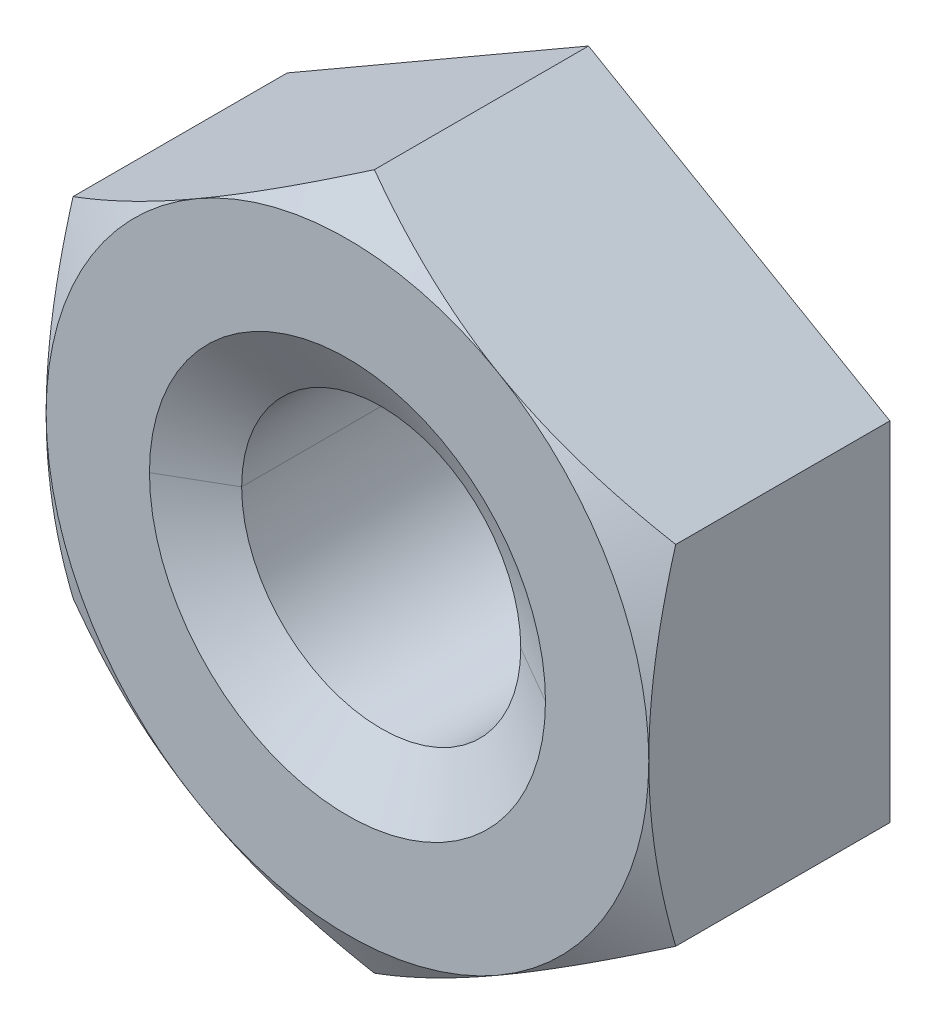
ISO-10303-21;
HEADER;
FILE_DESCRIPTION(('STEP AP214'),'2;1');
FILE_NAME('part.step','',(''),(''),'','','');
FILE_SCHEMA(('AUTOMOTIVE_DESIGN { 1 0 10303 214 1 1 1 1 }'));
ENDSEC;
DATA;
#1=APPLICATION_CONTEXT('core data for automotive mechanical design processes');
#2=APPLICATION_PROTOCOL_DEFINITION('international standard','automotive_design',2000,#1);
#3=PRODUCT_CONTEXT('',#1,'mechanical');
#4=PRODUCT('Part','Part','',(#3));
#5=PRODUCT_RELATED_PRODUCT_CATEGORY('part','',(#4));
#6=PRODUCT_DEFINITION_FORMATION('','',#4);
#7=PRODUCT_DEFINITION_CONTEXT('part definition',#1,'design');
#8=PRODUCT_DEFINITION('design','',#6,#7);
#9=PRODUCT_DEFINITION_SHAPE('','',#8);
#10=(LENGTH_UNIT() NAMED_UNIT(*) SI_UNIT(.MILLI.,.METRE.));
#11=(NAMED_UNIT(*) PLANE_ANGLE_UNIT() SI_UNIT($,.RADIAN.));
#12=(NAMED_UNIT(*) SI_UNIT($,.STERADIAN.) SOLID_ANGLE_UNIT());
#13=UNCERTAINTY_MEASURE_WITH_UNIT(LENGTH_MEASURE(1.E-05),#10,'distance_accuracy_value','');
#14=(GEOMETRIC_REPRESENTATION_CONTEXT(3) GLOBAL_UNCERTAINTY_ASSIGNED_CONTEXT((#13)) GLOBAL_UNIT_ASSIGNED_CONTEXT((#10,
#11,#12)) REPRESENTATION_CONTEXT('',''));
#15=CARTESIAN_POINT('',(0.,0.,0.));
#16=DIRECTION('',(0.,0.,1.));
#17=DIRECTION('',(1.,0.,0.));
#18=AXIS2_PLACEMENT_3D('',#15,#16,#17);
#19=CARTESIAN_POINT('',(0.,-2.95,-2.8));
#20=DIRECTION('',(0.,0.,-1.));
#21=DIRECTION('',(0.,-1.,0.));
#22=AXIS2_PLACEMENT_3D('',#19,#20,#21);
#23=PLANE('',#22);
#24=CARTESIAN_POINT('',(0.,0.,-2.8));
#25=DIRECTION('',(0.,0.,1.));
#26=DIRECTION('',(1.,0.,0.));
#27=AXIS2_PLACEMENT_3D('',#24,#25,#26);
#28=CIRCLE('',#27,2.95);
#29=CARTESIAN_POINT('',(2.95,0.,-2.8));
#30=VERTEX_POINT('',#29);
#31=CARTESIAN_POINT('',(-2.95,0.,-2.8));
#32=VERTEX_POINT('',#31);
#33=EDGE_CURVE('E484',#30,#32,#28,.T.);
#34=ORIENTED_EDGE('',*,*,#33,.T.);
#35=CARTESIAN_POINT('',(0.,0.,-2.8));
#36=DIRECTION('',(0.,0.,1.));
#37=DIRECTION('',(1.,0.,0.));
#38=AXIS2_PLACEMENT_3D('',#35,#36,#37);
#39=CIRCLE('',#38,2.95);
#40=EDGE_CURVE('E11',#32,#30,#39,.T.);
#41=ORIENTED_EDGE('',*,*,#40,.T.);
#42=EDGE_LOOP('',(#34,#41));
#43=FACE_BOUND('',#42,.T.);
#44=DIRECTION('',(0.,1.,0.));
#45=VECTOR('',#44,1.);
#46=CARTESIAN_POINT('',(3.5,-2.02072594216369,-2.8));
#47=LINE('',#46,#45);
#48=CARTESIAN_POINT('',(3.5,-2.02072594216369,-2.8));
#49=VERTEX_POINT('',#48);
#50=CARTESIAN_POINT('',(3.5,2.02072594216366,-2.8));
#51=VERTEX_POINT('',#50);
#52=EDGE_CURVE('E169',#49,#51,#47,.T.);
#53=ORIENTED_EDGE('',*,*,#52,.F.);
#54=DIRECTION('',(0.866025403784441,0.5,0.));
#55=VECTOR('',#54,1.);
#56=CARTESIAN_POINT('',(0.,-4.04145188432737,-2.8));
#57=LINE('',#56,#55);
#58=CARTESIAN_POINT('',(0.,-4.04145188432738,-2.8));
#59=VERTEX_POINT('',#58);
#60=EDGE_CURVE('E402',#59,#49,#57,.T.);
#61=ORIENTED_EDGE('',*,*,#60,.F.);
#62=DIRECTION('',(0.866025403784438,-0.5,0.));
#63=VECTOR('',#62,1.);
#64=CARTESIAN_POINT('',(-3.5,-2.02072594216367,-2.8));
#65=LINE('',#64,#63);
#66=CARTESIAN_POINT('',(-3.5,-2.02072594216368,-2.8));
#67=VERTEX_POINT('',#66);
#68=EDGE_CURVE('E550',#67,#59,#65,.T.);
#69=ORIENTED_EDGE('',*,*,#68,.F.);
#70=DIRECTION('',(0.,-1.,0.));
#71=VECTOR('',#70,1.);
#72=CARTESIAN_POINT('',(-3.5,2.0207259421637,-2.8));
#73=LINE('',#72,#71);
#74=CARTESIAN_POINT('',(-3.5,2.0207259421637,-2.8));
#75=VERTEX_POINT('',#74);
#76=EDGE_CURVE('E507',#75,#67,#73,.T.);
#77=ORIENTED_EDGE('',*,*,#76,.F.);
#78=DIRECTION('',(-0.866025403784439,-0.5,0.));
#79=VECTOR('',#78,1.);
#80=CARTESIAN_POINT('',(0.,4.04145188432738,-2.8));
#81=LINE('',#80,#79);
#82=CARTESIAN_POINT('',(0.,4.04145188432738,-2.8));
#83=VERTEX_POINT('',#82);
#84=EDGE_CURVE('E186',#83,#75,#81,.T.);
#85=ORIENTED_EDGE('',*,*,#84,.F.);
#86=DIRECTION('',(-0.866025403784437,0.5,0.));
#87=VECTOR('',#86,1.);
#88=CARTESIAN_POINT('',(3.5,2.02072594216367,-2.8));
#89=LINE('',#88,#87);
#90=EDGE_CURVE('E184',#51,#83,#89,.T.);
#91=ORIENTED_EDGE('',*,*,#90,.F.);
#92=EDGE_LOOP('',(#53,#61,#69,#77,#85,#91));
#93=FACE_BOUND('',#92,.T.);
#94=ADVANCED_FACE('F17',(#43,#93),#23,.T.);
#95=CARTESIAN_POINT('',(0.,0.,0.));
#96=DIRECTION('',(0.,0.,1.));
#97=DIRECTION('',(1.,0.,0.));
#98=AXIS2_PLACEMENT_3D('',#95,#96,#97);
#99=CYLINDRICAL_SURFACE('',#98,2.95);
#100=DIRECTION('',(0.,0.,1.));
#101=VECTOR('',#100,1.);
#102=CARTESIAN_POINT('',(-2.95,0.,0.));
#103=LINE('',#102,#101);
#104=CARTESIAN_POINT('',(-2.95,0.,-3.2));
#105=VERTEX_POINT('',#104);
#106=EDGE_CURVE('E488',#105,#32,#103,.T.);
#107=ORIENTED_EDGE('',*,*,#106,.F.);
#108=CARTESIAN_POINT('',(0.,0.,-3.2));
#109=DIRECTION('',(0.,0.,1.));
#110=DIRECTION('',(1.,0.,0.));
#111=AXIS2_PLACEMENT_3D('',#108,#109,#110);
#112=CIRCLE('',#111,2.95);
#113=CARTESIAN_POINT('',(2.95,0.,-3.2));
#114=VERTEX_POINT('',#113);
#115=EDGE_CURVE('E565',#105,#114,#112,.T.);
#116=ORIENTED_EDGE('',*,*,#115,.T.);
#117=DIRECTION('',(0.,0.,1.));
#118=VECTOR('',#117,1.);
#119=CARTESIAN_POINT('',(2.95,0.,0.));
#120=LINE('',#119,#118);
#121=EDGE_CURVE('E487',#114,#30,#120,.T.);
#122=ORIENTED_EDGE('',*,*,#121,.T.);
#123=ORIENTED_EDGE('',*,*,#40,.F.);
#124=EDGE_LOOP('',(#107,#116,#122,#123));
#125=FACE_BOUND('',#124,.T.);
#126=ADVANCED_FACE('F727',(#125),#99,.T.);
#127=CARTESIAN_POINT('',(0.,0.,0.));
#128=DIRECTION('',(0.,0.,-1.));
#129=DIRECTION('',(1.,0.,0.));
#130=AXIS2_PLACEMENT_3D('',#127,#128,#129);
#131=CONICAL_SURFACE('',#130,3.5,1.0471975511966);
#132=CARTESIAN_POINT('',(0.,0.,0.));
#133=DIRECTION('',(0.,0.,1.));
#134=DIRECTION('',(1.,0.,0.));
#135=AXIS2_PLACEMENT_3D('',#132,#133,#134);
#136=CIRCLE('',#135,3.5);
#137=CARTESIAN_POINT('',(3.5,0.,0.));
#138=VERTEX_POINT('',#137);
#139=CARTESIAN_POINT('',(1.75,3.03108891324553,0.));
#140=VERTEX_POINT('',#139);
#141=EDGE_CURVE('E359',#138,#140,#136,.T.);
#142=ORIENTED_EDGE('',*,*,#141,.F.);
#143=CARTESIAN_POINT('',(3.50000000000001,2.02072594216367,-0.31260739116964));
#144=CARTESIAN_POINT('',(3.50000000000001,1.49793539188129,-0.161690758701981));
#145=CARTESIAN_POINT('',(3.50000000000001,1.0255966782608,-0.084968602514275));
#146=CARTESIAN_POINT('',(3.50000000000001,0.502488851213621,0.));
#147=CARTESIAN_POINT('',(3.50000000000001,0.,0.));
#148=B_SPLINE_CURVE_WITH_KNOTS('',2,(#143,#144,#145,#146,#147),.UNSPECIFIED.,.F.,.F.,(3,2,3),
(0.,0.5,1.),.UNSPECIFIED.);
#149=CARTESIAN_POINT('',(3.5,2.02072594216367,-0.312607391169643));
#150=VERTEX_POINT('',#149);
#151=EDGE_CURVE('E181',#150,#138,#148,.T.);
#152=ORIENTED_EDGE('',*,*,#151,.F.);
#153=CARTESIAN_POINT('',(1.74999999999999,3.03108891324552,0.));
#154=CARTESIAN_POINT('',(2.1832669510642,2.78094212241763,0.));
#155=CARTESIAN_POINT('',(2.63508824335189,2.52008297768973,-0.0843875357508699));
#156=CARTESIAN_POINT('',(3.04504654740125,2.28339344049031,-0.160956240302545));
#157=CARTESIAN_POINT('',(3.5,2.02072594216367,-0.31260739116964));
#158=B_SPLINE_CURVE_WITH_KNOTS('',2,(#153,#154,#155,#156,#157),.UNSPECIFIED.,.F.,.F.,(3,2,3),
(0.,0.5,1.),.UNSPECIFIED.);
#159=EDGE_CURVE('E197',#140,#150,#158,.T.);
#160=ORIENTED_EDGE('',*,*,#159,.F.);
#161=EDGE_LOOP('',(#142,#152,#160));
#162=FACE_BOUND('',#161,.T.);
#163=ADVANCED_FACE('F723',(#162),#131,.T.);
#164=CARTESIAN_POINT('',(0.,0.,0.));
#165=DIRECTION('',(0.,0.,-1.));
#166=DIRECTION('',(1.,0.,0.));
#167=AXIS2_PLACEMENT_3D('',#164,#165,#166);
#168=CONICAL_SURFACE('',#167,3.5,1.0471975511966);
#169=CARTESIAN_POINT('',(0.,0.,0.));
#170=DIRECTION('',(0.,0.,1.));
#171=DIRECTION('',(1.,0.,0.));
#172=AXIS2_PLACEMENT_3D('',#169,#170,#171);
#173=CIRCLE('',#172,3.5);
#174=CARTESIAN_POINT('',(1.75,-3.03108891324554,0.));
#175=VERTEX_POINT('',#174);
#176=EDGE_CURVE('E350',#175,#138,#173,.T.);
#177=ORIENTED_EDGE('',*,*,#176,.F.);
#178=CARTESIAN_POINT('',(3.5,-2.02072594216368,-0.31260739116964));
#179=CARTESIAN_POINT('',(2.56217782649621,-2.56217782648809,0.));
#180=CARTESIAN_POINT('',(1.74999999999999,-3.03108891324553,0.));
#181=B_SPLINE_CURVE_WITH_KNOTS('',2,(#178,#179,#180),.UNSPECIFIED.,.F.,.F.,(3,3),(0.,1.),.UNSPECIFIED.);
#182=CARTESIAN_POINT('',(3.5,-2.02072594216369,-0.312607391169642));
#183=VERTEX_POINT('',#182);
#184=EDGE_CURVE('E367',#183,#175,#181,.T.);
#185=ORIENTED_EDGE('',*,*,#184,.F.);
#186=CARTESIAN_POINT('',(3.50000000000001,0.,0.));
#187=CARTESIAN_POINT('',(3.50000000000001,-0.4984652377082,0.));
#188=CARTESIAN_POINT('',(3.5,-1.01811561100061,-0.0837581115783154));
#189=CARTESIAN_POINT('',(3.5,-1.49327243399812,-0.16034467870742));
#190=CARTESIAN_POINT('',(3.5,-2.02072594216369,-0.31260739116964));
#191=B_SPLINE_CURVE_WITH_KNOTS('',2,(#186,#187,#188,#189,#190),.UNSPECIFIED.,.F.,.F.,(3,2,3),
(0.,0.5,1.),.UNSPECIFIED.);
#192=EDGE_CURVE('E403',#138,#183,#191,.T.);
#193=ORIENTED_EDGE('',*,*,#192,.F.);
#194=EDGE_LOOP('',(#177,#185,#193));
#195=FACE_BOUND('',#194,.T.);
#196=ADVANCED_FACE('F316',(#195),#168,.T.);
#197=CARTESIAN_POINT('',(0.,0.,0.));
#198=DIRECTION('',(0.,0.,-1.));
#199=DIRECTION('',(1.,0.,0.));
#200=AXIS2_PLACEMENT_3D('',#197,#198,#199);
#201=CONICAL_SURFACE('',#200,3.5,1.0471975511966);
#202=CARTESIAN_POINT('',(0.,0.,0.));
#203=DIRECTION('',(0.,0.,1.));
#204=DIRECTION('',(1.,0.,0.));
#205=AXIS2_PLACEMENT_3D('',#202,#203,#204);
#206=CIRCLE('',#205,3.5);
#207=CARTESIAN_POINT('',(-1.75,-3.03108891324552,0.));
#208=VERTEX_POINT('',#207);
#209=EDGE_CURVE('E585',#208,#175,#206,.T.);
#210=ORIENTED_EDGE('',*,*,#209,.F.);
#211=CARTESIAN_POINT('',(0.,-4.04145188432737,-0.312607391169633));
#212=CARTESIAN_POINT('',(-0.937822173503765,-3.50000000000296,0.));
#213=CARTESIAN_POINT('',(-1.74999999999999,-3.03108891324552,0.));
#214=B_SPLINE_CURVE_WITH_KNOTS('',2,(#211,#212,#213),.UNSPECIFIED.,.F.,.F.,(3,3),(0.,1.),.UNSPECIFIED.);
#215=CARTESIAN_POINT('',(0.,-4.04145188432737,-0.312607391169634));
#216=VERTEX_POINT('',#215);
#217=EDGE_CURVE('E624',#216,#208,#214,.T.);
#218=ORIENTED_EDGE('',*,*,#217,.F.);
#219=CARTESIAN_POINT('',(1.74999999999999,-3.03108891324553,0.));
#220=CARTESIAN_POINT('',(1.31673304893604,-3.28123570407327,0.));
#221=CARTESIAN_POINT('',(0.864911756648101,-3.54209484880132,-0.0843875357508651));
#222=CARTESIAN_POINT('',(0.454953452599052,-3.77878438600056,-0.160956240302435));
#223=CARTESIAN_POINT('',(0.,-4.04145188432737,-0.31260739116963));
#224=B_SPLINE_CURVE_WITH_KNOTS('',2,(#219,#220,#221,#222,#223),.UNSPECIFIED.,.F.,.F.,(3,2,3),
(0.,0.5,1.),.UNSPECIFIED.);
#225=EDGE_CURVE('E397',#175,#216,#224,.T.);
#226=ORIENTED_EDGE('',*,*,#225,.F.);
#227=EDGE_LOOP('',(#210,#218,#226));
#228=FACE_BOUND('',#227,.T.);
#229=ADVANCED_FACE('F329',(#228),#201,.T.);
#230=CARTESIAN_POINT('',(0.,0.,0.));
#231=DIRECTION('',(0.,0.,-1.));
#232=DIRECTION('',(1.,0.,0.));
#233=AXIS2_PLACEMENT_3D('',#230,#231,#232);
#234=CONICAL_SURFACE('',#233,3.5,1.0471975511966);
#235=CARTESIAN_POINT('',(0.,0.,0.));
#236=DIRECTION('',(0.,0.,1.));
#237=DIRECTION('',(1.,0.,0.));
#238=AXIS2_PLACEMENT_3D('',#235,#236,#237);
#239=CIRCLE('',#238,3.5);
#240=CARTESIAN_POINT('',(-3.5,0.,0.));
#241=VERTEX_POINT('',#240);
#242=EDGE_CURVE('E655',#241,#208,#239,.T.);
#243=ORIENTED_EDGE('',*,*,#242,.F.);
#244=CARTESIAN_POINT('',(-3.50000000000001,-2.02072594216441,-0.312607391169135));
#245=CARTESIAN_POINT('',(-3.50000000000001,-1.49386611828061,-0.160516060597985));
#246=CARTESIAN_POINT('',(-3.50000000000001,-1.0181156110009,-0.08375811157836));
#247=CARTESIAN_POINT('',(-3.50000000000001,-0.498977663971985,0.));
#248=CARTESIAN_POINT('',(-3.50000000000001,0.,0.));
#249=B_SPLINE_CURVE_WITH_KNOTS('',2,(#244,#245,#246,#247,#248),.UNSPECIFIED.,.F.,.F.,(3,2,3),
(0.,0.5,1.),.UNSPECIFIED.);
#250=CARTESIAN_POINT('',(-3.5,-2.02072594216441,-0.312607391169135));
#251=VERTEX_POINT('',#250);
#252=EDGE_CURVE('E502',#251,#241,#249,.T.);
#253=ORIENTED_EDGE('',*,*,#252,.F.);
#254=CARTESIAN_POINT('',(-1.74999999999999,-3.03108891324552,0.));
#255=CARTESIAN_POINT('',(-2.18326695106517,-2.78094212241707,0.));
#256=CARTESIAN_POINT('',(-2.63508824335169,-2.52008297768984,-0.0843875357508291));
#257=CARTESIAN_POINT('',(-3.04504654740057,-2.2833934404907,-0.160956240302574));
#258=CARTESIAN_POINT('',(-3.49999999999968,-2.02072594216386,-0.312607391169139));
#259=B_SPLINE_CURVE_WITH_KNOTS('',2,(#254,#255,#256,#257,#258),.UNSPECIFIED.,.F.,.F.,(3,2,3),
(0.,0.5,1.),.UNSPECIFIED.);
#260=EDGE_CURVE('E603',#208,#251,#259,.T.);
#261=ORIENTED_EDGE('',*,*,#260,.F.);
#262=EDGE_LOOP('',(#243,#253,#261));
#263=FACE_BOUND('',#262,.T.);
#264=ADVANCED_FACE('F333',(#263),#234,.T.);
#265=CARTESIAN_POINT('',(0.,0.,0.));
#266=DIRECTION('',(0.,0.,-1.));
#267=DIRECTION('',(1.,0.,0.));
#268=AXIS2_PLACEMENT_3D('',#265,#266,#267);
#269=CONICAL_SURFACE('',#268,3.5,1.0471975511966);
#270=CARTESIAN_POINT('',(0.,0.,0.));
#271=DIRECTION('',(0.,0.,1.));
#272=DIRECTION('',(1.,0.,0.));
#273=AXIS2_PLACEMENT_3D('',#270,#271,#272);
#274=CIRCLE('',#273,3.5);
#275=CARTESIAN_POINT('',(-1.75,3.03108891324554,0.));
#276=VERTEX_POINT('',#275);
#277=EDGE_CURVE('E45',#276,#241,#274,.T.);
#278=ORIENTED_EDGE('',*,*,#277,.F.);
#279=CARTESIAN_POINT('',(-3.5,2.0207259421637,-0.31260739116964));
#280=CARTESIAN_POINT('',(-2.5621778264962,2.56217782648811,0.));
#281=CARTESIAN_POINT('',(-1.75,3.03108891324554,0.));
#282=B_SPLINE_CURVE_WITH_KNOTS('',2,(#279,#280,#281),.UNSPECIFIED.,.F.,.F.,(3,3),(0.,1.),.UNSPECIFIED.);
#283=CARTESIAN_POINT('',(-3.5,2.0207259421637,-0.31260739116964));
#284=VERTEX_POINT('',#283);
#285=EDGE_CURVE('E270',#284,#276,#282,.T.);
#286=ORIENTED_EDGE('',*,*,#285,.F.);
#287=CARTESIAN_POINT('',(-3.50000000000001,0.,0.));
#288=CARTESIAN_POINT('',(-3.50000000000001,0.501976587736125,0.));
#289=CARTESIAN_POINT('',(-3.5,1.02559667826087,-0.0849686025142802));
#290=CARTESIAN_POINT('',(-3.5,1.49734159456367,-0.16151934418138));
#291=CARTESIAN_POINT('',(-3.5,2.0207259421637,-0.31260739116964));
#292=B_SPLINE_CURVE_WITH_KNOTS('',2,(#287,#288,#289,#290,#291),.UNSPECIFIED.,.F.,.F.,(3,2,3),
(0.,0.5,1.),.UNSPECIFIED.);
#293=EDGE_CURVE('E506',#241,#284,#292,.T.);
#294=ORIENTED_EDGE('',*,*,#293,.F.);
#295=EDGE_LOOP('',(#278,#286,#294));
#296=FACE_BOUND('',#295,.T.);
#297=ADVANCED_FACE('F315',(#296),#269,.T.);
#298=CARTESIAN_POINT('',(0.,0.,0.));
#299=DIRECTION('',(0.,0.,-1.));
#300=DIRECTION('',(1.,0.,0.));
#301=AXIS2_PLACEMENT_3D('',#298,#299,#300);
#302=CONICAL_SURFACE('',#301,3.5,1.0471975511966);
#303=CARTESIAN_POINT('',(-1.75,3.03108891324554,0.));
#304=CARTESIAN_POINT('',(-1.31673304893496,3.28123570407391,0.));
#305=CARTESIAN_POINT('',(-0.864911756648107,3.54209484880133,-0.0843875357508699));
#306=CARTESIAN_POINT('',(-0.454953452597759,3.77878438600132,-0.160956240302875));
#307=CARTESIAN_POINT('',(0.,4.04145188432738,-0.31260739116964));
#308=B_SPLINE_CURVE_WITH_KNOTS('',2,(#303,#304,#305,#306,#307),.UNSPECIFIED.,.F.,.F.,(3,2,3),
(0.,0.5,1.),.UNSPECIFIED.);
#309=CARTESIAN_POINT('',(0.,4.04145188432738,-0.312607391169641));
#310=VERTEX_POINT('',#309);
#311=EDGE_CURVE('E249',#276,#310,#308,.T.);
#312=ORIENTED_EDGE('',*,*,#311,.F.);
#313=CARTESIAN_POINT('',(0.,0.,0.));
#314=DIRECTION('',(0.,0.,1.));
#315=DIRECTION('',(1.,0.,0.));
#316=AXIS2_PLACEMENT_3D('',#313,#314,#315);
#317=CIRCLE('',#316,3.5);
#318=EDGE_CURVE('E252',#140,#276,#317,.T.);
#319=ORIENTED_EDGE('',*,*,#318,.F.);
#320=CARTESIAN_POINT('',(0.,4.04145188432737,-0.31260739116964));
#321=CARTESIAN_POINT('',(0.937822173503777,3.50000000000296,0.));
#322=CARTESIAN_POINT('',(1.74999999999999,3.03108891324552,0.));
#323=B_SPLINE_CURVE_WITH_KNOTS('',2,(#320,#321,#322),.UNSPECIFIED.,.F.,.F.,(3,3),(0.,1.),.UNSPECIFIED.);
#324=EDGE_CURVE('E247',#310,#140,#323,.T.);
#325=ORIENTED_EDGE('',*,*,#324,.F.);
#326=EDGE_LOOP('',(#312,#319,#325));
#327=FACE_BOUND('',#326,.T.);
#328=ADVANCED_FACE('F248',(#327),#302,.T.);
#329=CARTESIAN_POINT('',(0.,0.,-3.2));
#330=DIRECTION('',(0.,0.,-1.));
#331=DIRECTION('',(-1.,0.,0.));
#332=AXIS2_PLACEMENT_3D('',#329,#330,#331);
#333=CONICAL_SURFACE('',#332,2.3,1.0471975511966);
#334=DIRECTION('',(0.866025403784439,0.,-0.5));
#335=VECTOR('',#334,1.);
#336=CARTESIAN_POINT('',(2.3,0.,-3.2));
#337=LINE('',#336,#335);
#338=CARTESIAN_POINT('',(1.621125,0.,-2.8080513360039));
#339=VERTEX_POINT('',#338);
#340=CARTESIAN_POINT('',(2.3,0.,-3.2));
#341=VERTEX_POINT('',#340);
#342=EDGE_CURVE('E539',#339,#341,#337,.T.);
#343=ORIENTED_EDGE('',*,*,#342,.F.);
#344=CARTESIAN_POINT('',(0.,0.,-2.8080513360039));
#345=DIRECTION('',(0.,0.,1.));
#346=DIRECTION('',(1.,0.,0.));
#347=AXIS2_PLACEMENT_3D('',#344,#345,#346);
#348=CIRCLE('',#347,1.621125);
#349=CARTESIAN_POINT('',(-1.621125,0.,-2.8080513360039));
#350=VERTEX_POINT('',#349);
#351=EDGE_CURVE('E584',#339,#350,#348,.T.);
#352=ORIENTED_EDGE('',*,*,#351,.T.);
#353=DIRECTION('',(-0.866025403784439,0.,-0.5));
#354=VECTOR('',#353,1.);
#355=CARTESIAN_POINT('',(-2.3,0.,-3.2));
#356=LINE('',#355,#354);
#357=CARTESIAN_POINT('',(-2.3,0.,-3.2));
#358=VERTEX_POINT('',#357);
#359=EDGE_CURVE('E648',#350,#358,#356,.T.);
#360=ORIENTED_EDGE('',*,*,#359,.T.);
#361=CARTESIAN_POINT('',(0.,0.,-3.2));
#362=DIRECTION('',(0.,0.,1.));
#363=DIRECTION('',(1.,0.,0.));
#364=AXIS2_PLACEMENT_3D('',#361,#362,#363);
#365=CIRCLE('',#364,2.3);
#366=EDGE_CURVE('E360',#341,#358,#365,.T.);
#367=ORIENTED_EDGE('',*,*,#366,.F.);
#368=EDGE_LOOP('',(#343,#352,#360,#367));
#369=FACE_BOUND('',#368,.T.);
#370=ADVANCED_FACE('F314',(#369),#333,.F.);
#371=CARTESIAN_POINT('',(0.,0.,-0.391948663996105));
#372=DIRECTION('',(0.,0.,1.));
#373=DIRECTION('',(1.,0.,0.));
#374=AXIS2_PLACEMENT_3D('',#371,#372,#373);
#375=CONICAL_SURFACE('',#374,1.621125,1.0471975511966);
#376=DIRECTION('',(-0.866025403784439,0.,0.5));
#377=VECTOR('',#376,1.);
#378=CARTESIAN_POINT('',(-1.621125,0.,-0.391948663996105));
#379=LINE('',#378,#377);
#380=CARTESIAN_POINT('',(-1.621125,0.,-0.391948663996105));
#381=VERTEX_POINT('',#380);
#382=CARTESIAN_POINT('',(-2.3,0.,0.));
#383=VERTEX_POINT('',#382);
#384=EDGE_CURVE('E614',#381,#383,#379,.T.);
#385=ORIENTED_EDGE('',*,*,#384,.F.);
#386=CARTESIAN_POINT('',(0.,0.,-0.391948663996105));
#387=DIRECTION('',(0.,0.,1.));
#388=DIRECTION('',(1.,0.,0.));
#389=AXIS2_PLACEMENT_3D('',#386,#387,#388);
#390=CIRCLE('',#389,1.621125);
#391=CARTESIAN_POINT('',(1.621125,0.,-0.391948663996105));
#392=VERTEX_POINT('',#391);
#393=EDGE_CURVE('E30',#392,#381,#390,.T.);
#394=ORIENTED_EDGE('',*,*,#393,.F.);
#395=DIRECTION('',(0.866025403784439,0.,0.5));
#396=VECTOR('',#395,1.);
#397=CARTESIAN_POINT('',(1.621125,0.,-0.391948663996105));
#398=LINE('',#397,#396);
#399=CARTESIAN_POINT('',(2.3,0.,0.));
#400=VERTEX_POINT('',#399);
#401=EDGE_CURVE('E513',#392,#400,#398,.T.);
#402=ORIENTED_EDGE('',*,*,#401,.T.);
#403=CARTESIAN_POINT('',(0.,0.,0.));
#404=DIRECTION('',(0.,0.,1.));
#405=DIRECTION('',(1.,0.,0.));
#406=AXIS2_PLACEMENT_3D('',#403,#404,#405);
#407=CIRCLE('',#406,2.3);
#408=EDGE_CURVE('E159',#400,#383,#407,.T.);
#409=ORIENTED_EDGE('',*,*,#408,.T.);
#410=EDGE_LOOP('',(#385,#394,#402,#409));
#411=FACE_BOUND('',#410,.T.);
#412=ADVANCED_FACE('F19',(#411),#375,.F.);
#413=CARTESIAN_POINT('',(0.,0.,-3.2));
#414=DIRECTION('',(0.,0.,1.));
#415=DIRECTION('',(1.,0.,0.));
#416=AXIS2_PLACEMENT_3D('',#413,#414,#415);
#417=CYLINDRICAL_SURFACE('',#416,1.621125);
#418=DIRECTION('',(0.,0.,1.));
#419=VECTOR('',#418,1.);
#420=CARTESIAN_POINT('',(-1.621125,0.,-3.2));
#421=LINE('',#420,#419);
#422=EDGE_CURVE('E208',#350,#381,#421,.T.);
#423=ORIENTED_EDGE('',*,*,#422,.F.);
#424=ORIENTED_EDGE('',*,*,#351,.F.);
#425=DIRECTION('',(0.,0.,1.));
#426=VECTOR('',#425,1.);
#427=CARTESIAN_POINT('',(1.621125,0.,-3.2));
#428=LINE('',#427,#426);
#429=EDGE_CURVE('E200',#339,#392,#428,.T.);
#430=ORIENTED_EDGE('',*,*,#429,.T.);
#431=ORIENTED_EDGE('',*,*,#393,.T.);
#432=EDGE_LOOP('',(#423,#424,#430,#431));
#433=FACE_BOUND('',#432,.T.);
#434=ADVANCED_FACE('F288',(#433),#417,.F.);
#435=CARTESIAN_POINT('',(0.,4.04145188432738,0.));
#436=DIRECTION('',(0.,0.,1.));
#437=DIRECTION('',(1.,0.,0.));
#438=AXIS2_PLACEMENT_3D('',#435,#436,#437);
#439=PLANE('',#438);
#440=ORIENTED_EDGE('',*,*,#408,.F.);
#441=CARTESIAN_POINT('',(0.,0.,0.));
#442=DIRECTION('',(0.,0.,1.));
#443=DIRECTION('',(1.,0.,0.));
#444=AXIS2_PLACEMENT_3D('',#441,#442,#443);
#445=CIRCLE('',#444,2.3);
#446=EDGE_CURVE('E561',#383,#400,#445,.T.);
#447=ORIENTED_EDGE('',*,*,#446,.F.);
#448=EDGE_LOOP('',(#440,#447));
#449=FACE_BOUND('',#448,.T.);
#450=ORIENTED_EDGE('',*,*,#176,.T.);
#451=ORIENTED_EDGE('',*,*,#141,.T.);
#452=ORIENTED_EDGE('',*,*,#318,.T.);
#453=ORIENTED_EDGE('',*,*,#277,.T.);
#454=ORIENTED_EDGE('',*,*,#242,.T.);
#455=ORIENTED_EDGE('',*,*,#209,.T.);
#456=EDGE_LOOP('',(#450,#451,#452,#453,#454,#455));
#457=FACE_BOUND('',#456,.T.);
#458=ADVANCED_FACE('F326',(#449,#457),#439,.T.);
#459=CARTESIAN_POINT('',(0.,4.04145188432738,-3.2));
#460=DIRECTION('',(0.,0.,1.));
#461=DIRECTION('',(1.,0.,0.));
#462=AXIS2_PLACEMENT_3D('',#459,#460,#461);
#463=PLANE('',#462);
#464=CARTESIAN_POINT('',(0.,0.,-3.2));
#465=DIRECTION('',(0.,0.,1.));
#466=DIRECTION('',(1.,0.,0.));
#467=AXIS2_PLACEMENT_3D('',#464,#465,#466);
#468=CIRCLE('',#467,2.3);
#469=EDGE_CURVE('E597',#358,#341,#468,.T.);
#470=ORIENTED_EDGE('',*,*,#469,.T.);
#471=ORIENTED_EDGE('',*,*,#366,.T.);
#472=EDGE_LOOP('',(#470,#471));
#473=FACE_BOUND('',#472,.T.);
#474=CARTESIAN_POINT('',(0.,0.,-3.2));
#475=DIRECTION('',(0.,0.,1.));
#476=DIRECTION('',(1.,0.,0.));
#477=AXIS2_PLACEMENT_3D('',#474,#475,#476);
#478=CIRCLE('',#477,2.95);
#479=EDGE_CURVE('E479',#114,#105,#478,.T.);
#480=ORIENTED_EDGE('',*,*,#479,.F.);
#481=ORIENTED_EDGE('',*,*,#115,.F.);
#482=EDGE_LOOP('',(#480,#481));
#483=FACE_BOUND('',#482,.T.);
#484=ADVANCED_FACE('F233',(#473,#483),#463,.F.);
#485=CARTESIAN_POINT('',(0.,4.04145188432738,-3.2));
#486=DIRECTION('',(-0.5,0.866025403784439,0.));
#487=DIRECTION('',(0.,0.,1.));
#488=AXIS2_PLACEMENT_3D('',#485,#486,#487);
#489=PLANE('',#488);
#490=DIRECTION('',(0.,0.,1.));
#491=VECTOR('',#490,1.);
#492=CARTESIAN_POINT('',(0.,4.04145188432738,-3.2));
#493=LINE('',#492,#491);
#494=EDGE_CURVE('E191',#83,#310,#493,.T.);
#495=ORIENTED_EDGE('',*,*,#494,.F.);
#496=ORIENTED_EDGE('',*,*,#84,.T.);
#497=DIRECTION('',(0.,0.,1.));
#498=VECTOR('',#497,1.);
#499=CARTESIAN_POINT('',(-3.5,2.0207259421637,-3.2));
#500=LINE('',#499,#498);
#501=EDGE_CURVE('E578',#75,#284,#500,.T.);
#502=ORIENTED_EDGE('',*,*,#501,.T.);
#503=ORIENTED_EDGE('',*,*,#285,.T.);
#504=ORIENTED_EDGE('',*,*,#311,.T.);
#505=EDGE_LOOP('',(#495,#496,#502,#503,#504));
#506=FACE_BOUND('',#505,.T.);
#507=ADVANCED_FACE('F276',(#506),#489,.T.);
#508=CARTESIAN_POINT('',(-3.5,2.0207259421637,-3.2));
#509=DIRECTION('',(-1.,0.,0.));
#510=DIRECTION('',(0.,0.,1.));
#511=AXIS2_PLACEMENT_3D('',#508,#509,#510);
#512=PLANE('',#511);
#513=ORIENTED_EDGE('',*,*,#501,.F.);
#514=ORIENTED_EDGE('',*,*,#76,.T.);
#515=DIRECTION('',(0.,0.,1.));
#516=VECTOR('',#515,1.);
#517=CARTESIAN_POINT('',(-3.5,-2.02072594216367,-3.2));
#518=LINE('',#517,#516);
#519=EDGE_CURVE('E522',#67,#251,#518,.T.);
#520=ORIENTED_EDGE('',*,*,#519,.T.);
#521=ORIENTED_EDGE('',*,*,#252,.T.);
#522=ORIENTED_EDGE('',*,*,#293,.T.);
#523=EDGE_LOOP('',(#513,#514,#520,#521,#522));
#524=FACE_BOUND('',#523,.T.);
#525=ADVANCED_FACE('F286',(#524),#512,.T.);
#526=CARTESIAN_POINT('',(-3.5,-2.02072594216367,-3.2));
#527=DIRECTION('',(-0.5,-0.866025403784438,0.));
#528=DIRECTION('',(-0.866025403784438,0.5,0.));
#529=AXIS2_PLACEMENT_3D('',#526,#527,#528);
#530=PLANE('',#529);
#531=ORIENTED_EDGE('',*,*,#519,.F.);
#532=ORIENTED_EDGE('',*,*,#68,.T.);
#533=DIRECTION('',(0.,0.,1.));
#534=VECTOR('',#533,1.);
#535=CARTESIAN_POINT('',(0.,-4.04145188432737,-3.2));
#536=LINE('',#535,#534);
#537=EDGE_CURVE('E400',#59,#216,#536,.T.);
#538=ORIENTED_EDGE('',*,*,#537,.T.);
#539=ORIENTED_EDGE('',*,*,#217,.T.);
#540=ORIENTED_EDGE('',*,*,#260,.T.);
#541=EDGE_LOOP('',(#531,#532,#538,#539,#540));
#542=FACE_BOUND('',#541,.T.);
#543=ADVANCED_FACE('F382',(#542),#530,.T.);
#544=CARTESIAN_POINT('',(0.,-4.04145188432737,-3.2));
#545=DIRECTION('',(0.5,-0.866025403784441,0.));
#546=DIRECTION('',(0.,0.,-1.));
#547=AXIS2_PLACEMENT_3D('',#544,#545,#546);
#548=PLANE('',#547);
#549=ORIENTED_EDGE('',*,*,#537,.F.);
#550=ORIENTED_EDGE('',*,*,#60,.T.);
#551=DIRECTION('',(0.,0.,1.));
#552=VECTOR('',#551,1.);
#553=CARTESIAN_POINT('',(3.5,-2.02072594216369,-3.2));
#554=LINE('',#553,#552);
#555=EDGE_CURVE('E177',#49,#183,#554,.T.);
#556=ORIENTED_EDGE('',*,*,#555,.T.);
#557=ORIENTED_EDGE('',*,*,#184,.T.);
#558=ORIENTED_EDGE('',*,*,#225,.T.);
#559=EDGE_LOOP('',(#549,#550,#556,#557,#558));
#560=FACE_BOUND('',#559,.T.);
#561=ADVANCED_FACE('F373',(#560),#548,.T.);
#562=CARTESIAN_POINT('',(3.5,-2.02072594216369,-3.2));
#563=DIRECTION('',(1.,0.,0.));
#564=DIRECTION('',(0.,-1.,0.));
#565=AXIS2_PLACEMENT_3D('',#562,#563,#564);
#566=PLANE('',#565);
#567=ORIENTED_EDGE('',*,*,#555,.F.);
#568=ORIENTED_EDGE('',*,*,#52,.T.);
#569=DIRECTION('',(0.,0.,1.));
#570=VECTOR('',#569,1.);
#571=CARTESIAN_POINT('',(3.5,2.02072594216367,-3.2));
#572=LINE('',#571,#570);
#573=EDGE_CURVE('E174',#51,#150,#572,.T.);
#574=ORIENTED_EDGE('',*,*,#573,.T.);
#575=ORIENTED_EDGE('',*,*,#151,.T.);
#576=ORIENTED_EDGE('',*,*,#192,.T.);
#577=EDGE_LOOP('',(#567,#568,#574,#575,#576));
#578=FACE_BOUND('',#577,.T.);
#579=ADVANCED_FACE('F171',(#578),#566,.T.);
#580=CARTESIAN_POINT('',(3.5,2.02072594216367,-3.2));
#581=DIRECTION('',(0.5,0.866025403784437,0.));
#582=DIRECTION('',(0.,0.,-1.));
#583=AXIS2_PLACEMENT_3D('',#580,#581,#582);
#584=PLANE('',#583);
#585=ORIENTED_EDGE('',*,*,#573,.F.);
#586=ORIENTED_EDGE('',*,*,#90,.T.);
#587=ORIENTED_EDGE('',*,*,#494,.T.);
#588=ORIENTED_EDGE('',*,*,#324,.T.);
#589=ORIENTED_EDGE('',*,*,#159,.T.);
#590=EDGE_LOOP('',(#585,#586,#587,#588,#589));
#591=FACE_BOUND('',#590,.T.);
#592=ADVANCED_FACE('F194',(#591),#584,.T.);
#593=CARTESIAN_POINT('',(0.,0.,-3.2));
#594=DIRECTION('',(0.,0.,1.));
#595=DIRECTION('',(1.,0.,0.));
#596=AXIS2_PLACEMENT_3D('',#593,#594,#595);
#597=CYLINDRICAL_SURFACE('',#596,1.621125);
#598=CARTESIAN_POINT('',(0.,0.,-2.8080513360039));
#599=DIRECTION('',(0.,0.,1.));
#600=DIRECTION('',(1.,0.,0.));
#601=AXIS2_PLACEMENT_3D('',#598,#599,#600);
#602=CIRCLE('',#601,1.621125);
#603=EDGE_CURVE('E535',#350,#339,#602,.T.);
#604=ORIENTED_EDGE('',*,*,#603,.F.);
#605=ORIENTED_EDGE('',*,*,#422,.T.);
#606=CARTESIAN_POINT('',(0.,0.,-0.391948663996105));
#607=DIRECTION('',(0.,0.,1.));
#608=DIRECTION('',(1.,0.,0.));
#609=AXIS2_PLACEMENT_3D('',#606,#607,#608);
#610=CIRCLE('',#609,1.621125);
#611=EDGE_CURVE('E645',#381,#392,#610,.T.);
#612=ORIENTED_EDGE('',*,*,#611,.T.);
#613=ORIENTED_EDGE('',*,*,#429,.F.);
#614=EDGE_LOOP('',(#604,#605,#612,#613));
#615=FACE_BOUND('',#614,.T.);
#616=ADVANCED_FACE('F231',(#615),#597,.F.);
#617=CARTESIAN_POINT('',(0.,0.,-0.391948663996105));
#618=DIRECTION('',(0.,0.,1.));
#619=DIRECTION('',(1.,0.,0.));
#620=AXIS2_PLACEMENT_3D('',#617,#618,#619);
#621=CONICAL_SURFACE('',#620,1.621125,1.0471975511966);
#622=ORIENTED_EDGE('',*,*,#611,.F.);
#623=ORIENTED_EDGE('',*,*,#384,.T.);
#624=ORIENTED_EDGE('',*,*,#446,.T.);
#625=ORIENTED_EDGE('',*,*,#401,.F.);
#626=EDGE_LOOP('',(#622,#623,#624,#625));
#627=FACE_BOUND('',#626,.T.);
#628=ADVANCED_FACE('F324',(#627),#621,.F.);
#629=CARTESIAN_POINT('',(0.,0.,-3.2));
#630=DIRECTION('',(0.,0.,-1.));
#631=DIRECTION('',(-1.,0.,0.));
#632=AXIS2_PLACEMENT_3D('',#629,#630,#631);
#633=CONICAL_SURFACE('',#632,2.3,1.0471975511966);
#634=ORIENTED_EDGE('',*,*,#603,.T.);
#635=ORIENTED_EDGE('',*,*,#342,.T.);
#636=ORIENTED_EDGE('',*,*,#469,.F.);
#637=ORIENTED_EDGE('',*,*,#359,.F.);
#638=EDGE_LOOP('',(#634,#635,#636,#637));
#639=FACE_BOUND('',#638,.T.);
#640=ADVANCED_FACE('F384',(#639),#633,.F.);
#641=CARTESIAN_POINT('',(0.,0.,0.));
#642=DIRECTION('',(0.,0.,1.));
#643=DIRECTION('',(1.,0.,0.));
#644=AXIS2_PLACEMENT_3D('',#641,#642,#643);
#645=CYLINDRICAL_SURFACE('',#644,2.95);
#646=ORIENTED_EDGE('',*,*,#479,.T.);
#647=ORIENTED_EDGE('',*,*,#106,.T.);
#648=ORIENTED_EDGE('',*,*,#33,.F.);
#649=ORIENTED_EDGE('',*,*,#121,.F.);
#650=EDGE_LOOP('',(#646,#647,#648,#649));
#651=FACE_BOUND('',#650,.T.);
#652=ADVANCED_FACE('F700',(#651),#645,.T.);
#653=CLOSED_SHELL('',(#94,#126,#163,#196,#229,#264,#297,#328,#370,#412,#434,#458,#484,#507,#525,
#543,#561,#579,#592,#616,#628,#640,#652));
#654=MANIFOLD_SOLID_BREP('B1',#653);
#655=ADVANCED_BREP_SHAPE_REPRESENTATION('',(#18,#654),#14);
#656=SHAPE_DEFINITION_REPRESENTATION(#9,#655);
ENDSEC;
END-ISO-10303-21;
